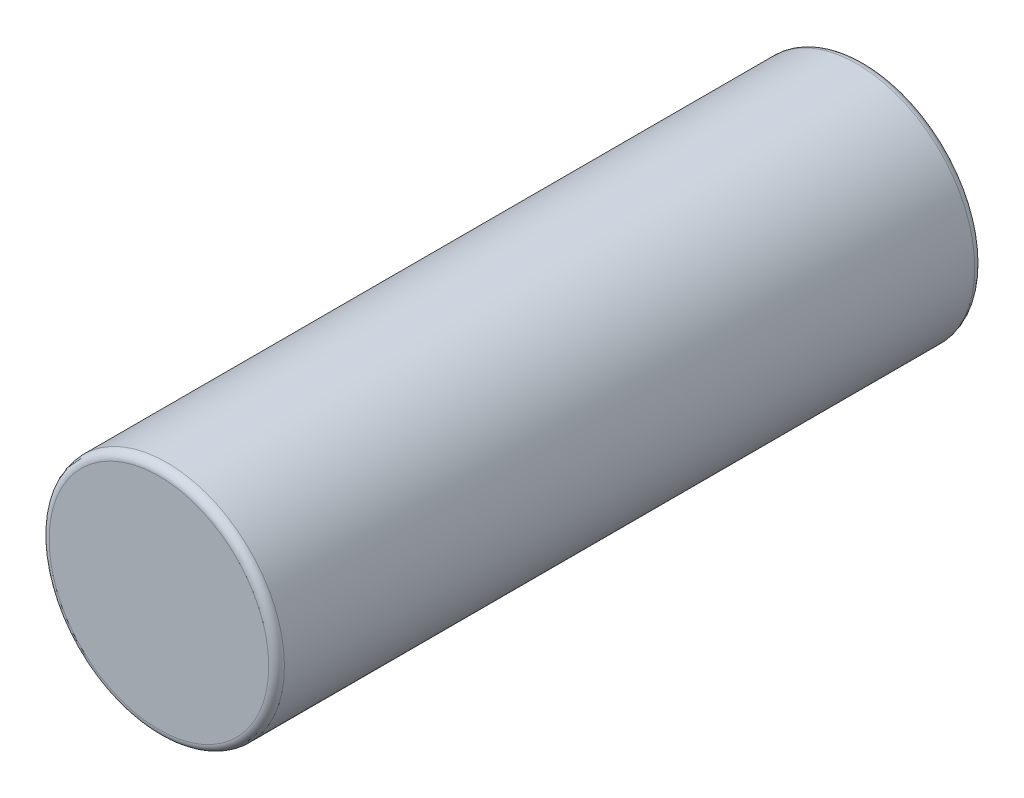
ISO-10303-21;
HEADER;
FILE_DESCRIPTION(('STEP AP214'),'2;1');
FILE_NAME('part.step','',(''),(''),'','','');
FILE_SCHEMA(('AUTOMOTIVE_DESIGN { 1 0 10303 214 1 1 1 1 }'));
ENDSEC;
DATA;
#1=APPLICATION_CONTEXT('core data for automotive mechanical design processes');
#2=APPLICATION_PROTOCOL_DEFINITION('international standard','automotive_design',2000,#1);
#3=PRODUCT_CONTEXT('',#1,'mechanical');
#4=PRODUCT('Part','Part','',(#3));
#5=PRODUCT_RELATED_PRODUCT_CATEGORY('part','',(#4));
#6=PRODUCT_DEFINITION_FORMATION('','',#4);
#7=PRODUCT_DEFINITION_CONTEXT('part definition',#1,'design');
#8=PRODUCT_DEFINITION('design','',#6,#7);
#9=PRODUCT_DEFINITION_SHAPE('','',#8);
#10=(LENGTH_UNIT() NAMED_UNIT(*) SI_UNIT(.MILLI.,.METRE.));
#11=(NAMED_UNIT(*) PLANE_ANGLE_UNIT() SI_UNIT($,.RADIAN.));
#12=(NAMED_UNIT(*) SI_UNIT($,.STERADIAN.) SOLID_ANGLE_UNIT());
#13=UNCERTAINTY_MEASURE_WITH_UNIT(LENGTH_MEASURE(1.E-05),#10,'distance_accuracy_value','');
#14=(GEOMETRIC_REPRESENTATION_CONTEXT(3) GLOBAL_UNCERTAINTY_ASSIGNED_CONTEXT((#13)) GLOBAL_UNIT_ASSIGNED_CONTEXT((#10,
#11,#12)) REPRESENTATION_CONTEXT('',''));
#15=CARTESIAN_POINT('',(0.,0.,0.));
#16=DIRECTION('',(0.,0.,1.));
#17=DIRECTION('',(1.,0.,0.));
#18=AXIS2_PLACEMENT_3D('',#15,#16,#17);
#19=CARTESIAN_POINT('',(0.,0.,-2.25));
#20=DIRECTION('',(0.,0.,1.));
#21=DIRECTION('',(1.,0.,0.));
#22=AXIS2_PLACEMENT_3D('',#19,#20,#21);
#23=CYLINDRICAL_SURFACE('',#22,0.75);
#24=CARTESIAN_POINT('',(0.,0.,-2.2));
#25=DIRECTION('',(0.,0.,1.));
#26=DIRECTION('',(1.,0.,0.));
#27=AXIS2_PLACEMENT_3D('',#24,#25,#26);
#28=CIRCLE('',#27,0.75);
#29=CARTESIAN_POINT('',(0.75,0.,-2.2));
#30=VERTEX_POINT('',#29);
#31=EDGE_CURVE('E44',#30,#30,#28,.T.);
#32=ORIENTED_EDGE('',*,*,#31,.T.);
#33=EDGE_LOOP('',(#32));
#34=FACE_BOUND('',#33,.T.);
#35=CARTESIAN_POINT('',(0.,0.,2.2));
#36=DIRECTION('',(0.,0.,1.));
#37=DIRECTION('',(1.,0.,0.));
#38=AXIS2_PLACEMENT_3D('',#35,#36,#37);
#39=CIRCLE('',#38,0.75);
#40=CARTESIAN_POINT('',(0.75,0.,2.2));
#41=VERTEX_POINT('',#40);
#42=EDGE_CURVE('E48',#41,#41,#39,.F.);
#43=ORIENTED_EDGE('',*,*,#42,.T.);
#44=EDGE_LOOP('',(#43));
#45=FACE_BOUND('',#44,.T.);
#46=ADVANCED_FACE('F33',(#34,#45),#23,.T.);
#47=CARTESIAN_POINT('',(0.,0.,-2.25));
#48=DIRECTION('',(0.,0.,1.));
#49=DIRECTION('',(1.,0.,0.));
#50=AXIS2_PLACEMENT_3D('',#47,#48,#49);
#51=PLANE('',#50);
#52=CARTESIAN_POINT('',(0.,0.,-2.25));
#53=DIRECTION('',(0.,0.,1.));
#54=DIRECTION('',(1.,0.,0.));
#55=AXIS2_PLACEMENT_3D('',#52,#53,#54);
#56=CIRCLE('',#55,0.7);
#57=CARTESIAN_POINT('',(0.7,0.,-2.25));
#58=VERTEX_POINT('',#57);
#59=EDGE_CURVE('E40',#58,#58,#56,.F.);
#60=ORIENTED_EDGE('',*,*,#59,.T.);
#61=EDGE_LOOP('',(#60));
#62=FACE_BOUND('',#61,.T.);
#63=ADVANCED_FACE('F64',(#62),#51,.F.);
#64=CARTESIAN_POINT('',(0.,0.,2.25));
#65=DIRECTION('',(0.,0.,1.));
#66=DIRECTION('',(1.,0.,0.));
#67=AXIS2_PLACEMENT_3D('',#64,#65,#66);
#68=PLANE('',#67);
#69=CARTESIAN_POINT('',(0.,0.,2.25));
#70=DIRECTION('',(0.,0.,1.));
#71=DIRECTION('',(1.,0.,0.));
#72=AXIS2_PLACEMENT_3D('',#69,#70,#71);
#73=CIRCLE('',#72,0.7);
#74=CARTESIAN_POINT('',(0.7,0.,2.25));
#75=VERTEX_POINT('',#74);
#76=EDGE_CURVE('E10',#75,#75,#73,.T.);
#77=ORIENTED_EDGE('',*,*,#76,.T.);
#78=EDGE_LOOP('',(#77));
#79=FACE_BOUND('',#78,.T.);
#80=ADVANCED_FACE('F61',(#79),#68,.T.);
#81=CARTESIAN_POINT('',(0.,0.,-2.2));
#82=DIRECTION('',(0.,0.,1.));
#83=DIRECTION('',(1.,0.,0.));
#84=AXIS2_PLACEMENT_3D('',#81,#82,#83);
#85=TOROIDAL_SURFACE('',#84,0.7,0.05);
#86=ORIENTED_EDGE('',*,*,#59,.F.);
#87=EDGE_LOOP('',(#86));
#88=FACE_BOUND('',#87,.T.);
#89=ORIENTED_EDGE('',*,*,#31,.F.);
#90=EDGE_LOOP('',(#89));
#91=FACE_BOUND('',#90,.T.);
#92=ADVANCED_FACE('F57',(#88,#91),#85,.T.);
#93=CARTESIAN_POINT('',(0.,0.,2.2));
#94=DIRECTION('',(0.,0.,1.));
#95=DIRECTION('',(1.,0.,0.));
#96=AXIS2_PLACEMENT_3D('',#93,#94,#95);
#97=TOROIDAL_SURFACE('',#96,0.7,0.05);
#98=ORIENTED_EDGE('',*,*,#42,.F.);
#99=EDGE_LOOP('',(#98));
#100=FACE_BOUND('',#99,.T.);
#101=ORIENTED_EDGE('',*,*,#76,.F.);
#102=EDGE_LOOP('',(#101));
#103=FACE_BOUND('',#102,.T.);
#104=ADVANCED_FACE('F35',(#100,#103),#97,.T.);
#105=CLOSED_SHELL('',(#46,#63,#80,#92,#104));
#106=MANIFOLD_SOLID_BREP('B2',#105);
#107=ADVANCED_BREP_SHAPE_REPRESENTATION('',(#18,#106),#14);
#108=SHAPE_DEFINITION_REPRESENTATION(#9,#107);
ENDSEC;
END-ISO-10303-21;
